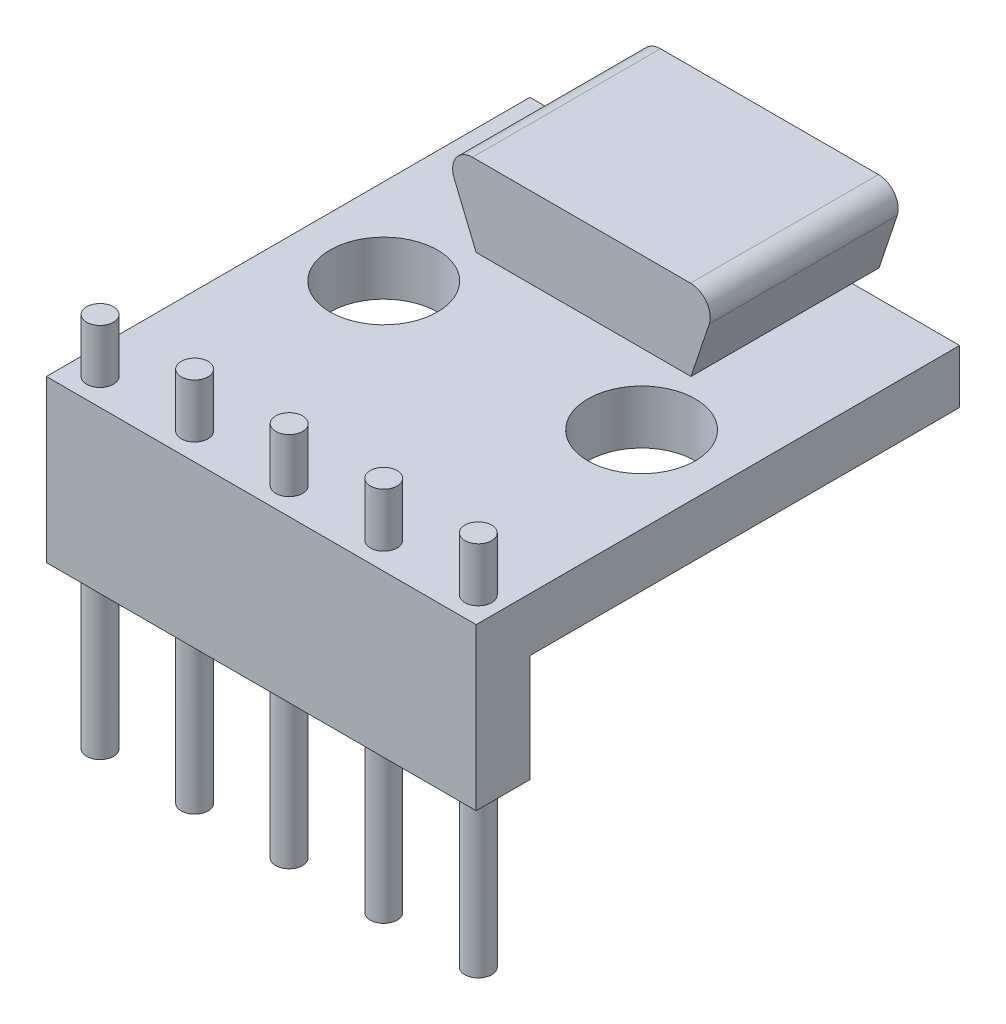
ISO-10303-21;
HEADER;
FILE_DESCRIPTION(('STEP AP214'),'2;1');
FILE_NAME('part.step','',(''),(''),'','','');
FILE_SCHEMA(('AUTOMOTIVE_DESIGN { 1 0 10303 214 1 1 1 1 }'));
ENDSEC;
DATA;
#1=APPLICATION_CONTEXT('core data for automotive mechanical design processes');
#2=APPLICATION_PROTOCOL_DEFINITION('international standard','automotive_design',2000,#1);
#3=PRODUCT_CONTEXT('',#1,'mechanical');
#4=PRODUCT('Part','Part','',(#3));
#5=PRODUCT_RELATED_PRODUCT_CATEGORY('part','',(#4));
#6=PRODUCT_DEFINITION_FORMATION('','',#4);
#7=PRODUCT_DEFINITION_CONTEXT('part definition',#1,'design');
#8=PRODUCT_DEFINITION('design','',#6,#7);
#9=PRODUCT_DEFINITION_SHAPE('','',#8);
#10=(LENGTH_UNIT() NAMED_UNIT(*) SI_UNIT(.MILLI.,.METRE.));
#11=(NAMED_UNIT(*) PLANE_ANGLE_UNIT() SI_UNIT($,.RADIAN.));
#12=(NAMED_UNIT(*) SI_UNIT($,.STERADIAN.) SOLID_ANGLE_UNIT());
#13=UNCERTAINTY_MEASURE_WITH_UNIT(LENGTH_MEASURE(1.E-05),#10,'distance_accuracy_value','');
#14=(GEOMETRIC_REPRESENTATION_CONTEXT(3) GLOBAL_UNCERTAINTY_ASSIGNED_CONTEXT((#13)) GLOBAL_UNIT_ASSIGNED_CONTEXT((#10,
#11,#12)) REPRESENTATION_CONTEXT('',''));
#15=CARTESIAN_POINT('',(0.,0.,0.));
#16=DIRECTION('',(0.,0.,1.));
#17=DIRECTION('',(1.,0.,0.));
#18=AXIS2_PLACEMENT_3D('',#15,#16,#17);
#19=CARTESIAN_POINT('',(0.,0.,0.));
#20=DIRECTION('',(0.,1.,0.));
#21=DIRECTION('',(0.,0.,1.));
#22=AXIS2_PLACEMENT_3D('',#19,#20,#21);
#23=PLANE('',#22);
#24=CARTESIAN_POINT('',(0.79375,0.,13.49375));
#25=DIRECTION('',(0.,1.,0.));
#26=DIRECTION('',(0.,0.,1.));
#27=AXIS2_PLACEMENT_3D('',#24,#25,#26);
#28=CIRCLE('',#27,0.396875);
#29=CARTESIAN_POINT('',(0.79375,0.,13.890625));
#30=VERTEX_POINT('',#29);
#31=EDGE_CURVE('E224',#30,#30,#28,.T.);
#32=ORIENTED_EDGE('',*,*,#31,.F.);
#33=EDGE_LOOP('',(#32));
#34=FACE_BOUND('',#33,.T.);
#35=CARTESIAN_POINT('',(3.58775,0.,13.49375));
#36=DIRECTION('',(0.,1.,0.));
#37=DIRECTION('',(0.,0.,1.));
#38=AXIS2_PLACEMENT_3D('',#35,#36,#37);
#39=CIRCLE('',#38,0.396875);
#40=CARTESIAN_POINT('',(3.58775,0.,13.890625));
#41=VERTEX_POINT('',#40);
#42=EDGE_CURVE('E228',#41,#41,#39,.T.);
#43=ORIENTED_EDGE('',*,*,#42,.F.);
#44=EDGE_LOOP('',(#43));
#45=FACE_BOUND('',#44,.T.);
#46=CARTESIAN_POINT('',(6.38175,0.,13.49375));
#47=DIRECTION('',(0.,1.,0.));
#48=DIRECTION('',(0.,0.,1.));
#49=AXIS2_PLACEMENT_3D('',#46,#47,#48);
#50=CIRCLE('',#49,0.396875);
#51=CARTESIAN_POINT('',(6.38175,0.,13.890625));
#52=VERTEX_POINT('',#51);
#53=EDGE_CURVE('E231',#52,#52,#50,.T.);
#54=ORIENTED_EDGE('',*,*,#53,.F.);
#55=EDGE_LOOP('',(#54));
#56=FACE_BOUND('',#55,.T.);
#57=CARTESIAN_POINT('',(9.17575,0.,13.49375));
#58=DIRECTION('',(0.,1.,0.));
#59=DIRECTION('',(0.,0.,1.));
#60=AXIS2_PLACEMENT_3D('',#57,#58,#59);
#61=CIRCLE('',#60,0.396875000000001);
#62=CARTESIAN_POINT('',(9.17575,0.,13.890625));
#63=VERTEX_POINT('',#62);
#64=EDGE_CURVE('E234',#63,#63,#61,.T.);
#65=ORIENTED_EDGE('',*,*,#64,.F.);
#66=EDGE_LOOP('',(#65));
#67=FACE_BOUND('',#66,.T.);
#68=CARTESIAN_POINT('',(11.96975,0.,13.49375));
#69=DIRECTION('',(0.,1.,0.));
#70=DIRECTION('',(0.,0.,1.));
#71=AXIS2_PLACEMENT_3D('',#68,#69,#70);
#72=CIRCLE('',#71,0.396875000000001);
#73=CARTESIAN_POINT('',(11.96975,0.,13.890625));
#74=VERTEX_POINT('',#73);
#75=EDGE_CURVE('E223',#74,#74,#72,.T.);
#76=ORIENTED_EDGE('',*,*,#75,.F.);
#77=EDGE_LOOP('',(#76));
#78=FACE_BOUND('',#77,.T.);
#79=CARTESIAN_POINT('',(2.54,0.,6.858));
#80=DIRECTION('',(0.,1.,0.));
#81=DIRECTION('',(0.,0.,1.));
#82=AXIS2_PLACEMENT_3D('',#79,#80,#81);
#83=CIRCLE('',#82,1.5875);
#84=CARTESIAN_POINT('',(2.54,0.,8.4455));
#85=VERTEX_POINT('',#84);
#86=EDGE_CURVE('E256',#85,#85,#83,.T.);
#87=ORIENTED_EDGE('',*,*,#86,.F.);
#88=EDGE_LOOP('',(#87));
#89=FACE_BOUND('',#88,.T.);
#90=CARTESIAN_POINT('',(10.16,0.,6.858));
#91=DIRECTION('',(0.,1.,0.));
#92=DIRECTION('',(0.,0.,1.));
#93=AXIS2_PLACEMENT_3D('',#90,#91,#92);
#94=CIRCLE('',#93,1.5875);
#95=CARTESIAN_POINT('',(10.16,0.,8.4455));
#96=VERTEX_POINT('',#95);
#97=EDGE_CURVE('E262',#96,#96,#94,.T.);
#98=ORIENTED_EDGE('',*,*,#97,.F.);
#99=EDGE_LOOP('',(#98));
#100=FACE_BOUND('',#99,.T.);
#101=DIRECTION('',(-1.,0.,0.));
#102=VECTOR('',#101,1.);
#103=CARTESIAN_POINT('',(3.175,0.,4.7625));
#104=LINE('',#103,#102);
#105=CARTESIAN_POINT('',(9.525,0.,4.7625));
#106=VERTEX_POINT('',#105);
#107=CARTESIAN_POINT('',(3.175,0.,4.7625));
#108=VERTEX_POINT('',#107);
#109=EDGE_CURVE('E47',#106,#108,#104,.T.);
#110=ORIENTED_EDGE('',*,*,#109,.T.);
#111=DIRECTION('',(0.,0.,-1.));
#112=VECTOR('',#111,1.);
#113=CARTESIAN_POINT('',(3.175,0.,0.));
#114=LINE('',#113,#112);
#115=CARTESIAN_POINT('',(3.175,0.,0.));
#116=VERTEX_POINT('',#115);
#117=EDGE_CURVE('E11',#108,#116,#114,.T.);
#118=ORIENTED_EDGE('',*,*,#117,.T.);
#119=DIRECTION('',(-1.,0.,0.));
#120=VECTOR('',#119,1.);
#121=CARTESIAN_POINT('',(0.,0.,0.));
#122=LINE('',#121,#120);
#123=CARTESIAN_POINT('',(0.,0.,0.));
#124=VERTEX_POINT('',#123);
#125=EDGE_CURVE('E289',#116,#124,#122,.T.);
#126=ORIENTED_EDGE('',*,*,#125,.T.);
#127=DIRECTION('',(0.,0.,1.));
#128=VECTOR('',#127,1.);
#129=CARTESIAN_POINT('',(0.,0.,0.));
#130=LINE('',#129,#128);
#131=CARTESIAN_POINT('',(0.,0.,14.2875));
#132=VERTEX_POINT('',#131);
#133=EDGE_CURVE('E268',#124,#132,#130,.T.);
#134=ORIENTED_EDGE('',*,*,#133,.T.);
#135=DIRECTION('',(1.,0.,0.));
#136=VECTOR('',#135,1.);
#137=CARTESIAN_POINT('',(0.,0.,14.2875));
#138=LINE('',#137,#136);
#139=CARTESIAN_POINT('',(12.7,0.,14.2875));
#140=VERTEX_POINT('',#139);
#141=EDGE_CURVE('E283',#132,#140,#138,.T.);
#142=ORIENTED_EDGE('',*,*,#141,.T.);
#143=DIRECTION('',(0.,0.,-1.));
#144=VECTOR('',#143,1.);
#145=CARTESIAN_POINT('',(12.7,0.,0.));
#146=LINE('',#145,#144);
#147=CARTESIAN_POINT('',(12.7,0.,0.));
#148=VERTEX_POINT('',#147);
#149=EDGE_CURVE('E286',#140,#148,#146,.T.);
#150=ORIENTED_EDGE('',*,*,#149,.T.);
#151=CARTESIAN_POINT('',(9.525,0.,0.));
#152=VERTEX_POINT('',#151);
#153=EDGE_CURVE('E275',#148,#152,#122,.T.);
#154=ORIENTED_EDGE('',*,*,#153,.T.);
#155=DIRECTION('',(0.,0.,1.));
#156=VECTOR('',#155,1.);
#157=CARTESIAN_POINT('',(9.525,0.,0.));
#158=LINE('',#157,#156);
#159=EDGE_CURVE('E41',#152,#106,#158,.T.);
#160=ORIENTED_EDGE('',*,*,#159,.T.);
#161=EDGE_LOOP('',(#110,#118,#126,#134,#142,#150,#154,#160));
#162=FACE_BOUND('',#161,.T.);
#163=ADVANCED_FACE('F33',(#34,#45,#56,#67,#78,#89,#100,#162),#23,.T.);
#164=CARTESIAN_POINT('',(0.,-1.5875,0.));
#165=DIRECTION('',(-1.,0.,0.));
#166=DIRECTION('',(0.,0.,1.));
#167=AXIS2_PLACEMENT_3D('',#164,#165,#166);
#168=PLANE('',#167);
#169=ORIENTED_EDGE('',*,*,#133,.F.);
#170=DIRECTION('',(0.,1.,0.));
#171=VECTOR('',#170,1.);
#172=CARTESIAN_POINT('',(0.,-1.5875,0.));
#173=LINE('',#172,#171);
#174=CARTESIAN_POINT('',(0.,-1.5875,0.));
#175=VERTEX_POINT('',#174);
#176=EDGE_CURVE('E293',#175,#124,#173,.T.);
#177=ORIENTED_EDGE('',*,*,#176,.F.);
#178=DIRECTION('',(0.,0.,1.));
#179=VECTOR('',#178,1.);
#180=CARTESIAN_POINT('',(0.,-1.5875,0.));
#181=LINE('',#180,#179);
#182=CARTESIAN_POINT('',(0.,-1.5875,12.7));
#183=VERTEX_POINT('',#182);
#184=EDGE_CURVE('E271',#175,#183,#181,.T.);
#185=ORIENTED_EDGE('',*,*,#184,.T.);
#186=DIRECTION('',(0.,-1.,0.));
#187=VECTOR('',#186,1.);
#188=CARTESIAN_POINT('',(0.,-1.5875,12.7));
#189=LINE('',#188,#187);
#190=CARTESIAN_POINT('',(0.,-4.7625,12.7));
#191=VERTEX_POINT('',#190);
#192=EDGE_CURVE('E239',#183,#191,#189,.T.);
#193=ORIENTED_EDGE('',*,*,#192,.T.);
#194=DIRECTION('',(0.,0.,1.));
#195=VECTOR('',#194,1.);
#196=CARTESIAN_POINT('',(0.,-4.7625,12.7));
#197=LINE('',#196,#195);
#198=CARTESIAN_POINT('',(0.,-4.7625,14.2875));
#199=VERTEX_POINT('',#198);
#200=EDGE_CURVE('E250',#191,#199,#197,.T.);
#201=ORIENTED_EDGE('',*,*,#200,.T.);
#202=DIRECTION('',(0.,1.,0.));
#203=VECTOR('',#202,1.);
#204=CARTESIAN_POINT('',(0.,-1.5875,14.2875));
#205=LINE('',#204,#203);
#206=EDGE_CURVE('E280',#199,#132,#205,.T.);
#207=ORIENTED_EDGE('',*,*,#206,.T.);
#208=EDGE_LOOP('',(#169,#177,#185,#193,#201,#207));
#209=FACE_BOUND('',#208,.T.);
#210=ADVANCED_FACE('F35',(#209),#168,.T.);
#211=CARTESIAN_POINT('',(0.,-1.5875,0.));
#212=DIRECTION('',(0.,0.,-1.));
#213=DIRECTION('',(-1.,0.,0.));
#214=AXIS2_PLACEMENT_3D('',#211,#212,#213);
#215=PLANE('',#214);
#216=ORIENTED_EDGE('',*,*,#153,.F.);
#217=DIRECTION('',(0.,1.,0.));
#218=VECTOR('',#217,1.);
#219=CARTESIAN_POINT('',(12.7,-1.5875,0.));
#220=LINE('',#219,#218);
#221=CARTESIAN_POINT('',(12.7,-1.5875,0.));
#222=VERTEX_POINT('',#221);
#223=EDGE_CURVE('E296',#222,#148,#220,.T.);
#224=ORIENTED_EDGE('',*,*,#223,.F.);
#225=DIRECTION('',(-1.,0.,0.));
#226=VECTOR('',#225,1.);
#227=CARTESIAN_POINT('',(0.,-1.5875,0.));
#228=LINE('',#227,#226);
#229=EDGE_CURVE('E277',#222,#175,#228,.T.);
#230=ORIENTED_EDGE('',*,*,#229,.T.);
#231=ORIENTED_EDGE('',*,*,#176,.T.);
#232=ORIENTED_EDGE('',*,*,#125,.F.);
#233=EDGE_CURVE('E292',#152,#116,#122,.T.);
#234=ORIENTED_EDGE('',*,*,#233,.F.);
#235=EDGE_LOOP('',(#216,#224,#230,#231,#232,#234));
#236=FACE_BOUND('',#235,.T.);
#237=ADVANCED_FACE('F324',(#236),#215,.T.);
#238=CARTESIAN_POINT('',(12.7,-1.5875,0.));
#239=DIRECTION('',(1.,0.,0.));
#240=DIRECTION('',(0.,0.,-1.));
#241=AXIS2_PLACEMENT_3D('',#238,#239,#240);
#242=PLANE('',#241);
#243=ORIENTED_EDGE('',*,*,#149,.F.);
#244=DIRECTION('',(0.,1.,0.));
#245=VECTOR('',#244,1.);
#246=CARTESIAN_POINT('',(12.7,-1.5875,14.2875));
#247=LINE('',#246,#245);
#248=CARTESIAN_POINT('',(12.7,-4.7625,14.2875));
#249=VERTEX_POINT('',#248);
#250=EDGE_CURVE('E298',#249,#140,#247,.T.);
#251=ORIENTED_EDGE('',*,*,#250,.F.);
#252=DIRECTION('',(0.,0.,1.));
#253=VECTOR('',#252,1.);
#254=CARTESIAN_POINT('',(12.7,-4.7625,12.7));
#255=LINE('',#254,#253);
#256=CARTESIAN_POINT('',(12.7,-4.7625,12.7));
#257=VERTEX_POINT('',#256);
#258=EDGE_CURVE('E253',#257,#249,#255,.T.);
#259=ORIENTED_EDGE('',*,*,#258,.F.);
#260=DIRECTION('',(0.,1.,0.));
#261=VECTOR('',#260,1.);
#262=CARTESIAN_POINT('',(12.7,-1.5875,12.7));
#263=LINE('',#262,#261);
#264=CARTESIAN_POINT('',(12.7,-1.5875,12.7));
#265=VERTEX_POINT('',#264);
#266=EDGE_CURVE('E245',#257,#265,#263,.T.);
#267=ORIENTED_EDGE('',*,*,#266,.T.);
#268=DIRECTION('',(0.,0.,-1.));
#269=VECTOR('',#268,1.);
#270=CARTESIAN_POINT('',(12.7,-1.5875,0.));
#271=LINE('',#270,#269);
#272=EDGE_CURVE('E274',#265,#222,#271,.T.);
#273=ORIENTED_EDGE('',*,*,#272,.T.);
#274=ORIENTED_EDGE('',*,*,#223,.T.);
#275=EDGE_LOOP('',(#243,#251,#259,#267,#273,#274));
#276=FACE_BOUND('',#275,.T.);
#277=ADVANCED_FACE('F345',(#276),#242,.T.);
#278=CARTESIAN_POINT('',(0.,-1.5875,14.2875));
#279=DIRECTION('',(0.,0.,1.));
#280=DIRECTION('',(1.,0.,0.));
#281=AXIS2_PLACEMENT_3D('',#278,#279,#280);
#282=PLANE('',#281);
#283=ORIENTED_EDGE('',*,*,#141,.F.);
#284=ORIENTED_EDGE('',*,*,#206,.F.);
#285=DIRECTION('',(1.,0.,0.));
#286=VECTOR('',#285,1.);
#287=CARTESIAN_POINT('',(0.,-4.7625,14.2875));
#288=LINE('',#287,#286);
#289=EDGE_CURVE('E227',#199,#249,#288,.T.);
#290=ORIENTED_EDGE('',*,*,#289,.T.);
#291=ORIENTED_EDGE('',*,*,#250,.T.);
#292=EDGE_LOOP('',(#283,#284,#290,#291));
#293=FACE_BOUND('',#292,.T.);
#294=ADVANCED_FACE('F332',(#293),#282,.T.);
#295=CARTESIAN_POINT('',(0.,-1.5875,0.));
#296=DIRECTION('',(0.,1.,0.));
#297=DIRECTION('',(0.,0.,1.));
#298=AXIS2_PLACEMENT_3D('',#295,#296,#297);
#299=PLANE('',#298);
#300=CARTESIAN_POINT('',(2.54,-1.5875,6.858));
#301=DIRECTION('',(0.,1.,0.));
#302=DIRECTION('',(0.,0.,1.));
#303=AXIS2_PLACEMENT_3D('',#300,#301,#302);
#304=CIRCLE('',#303,1.5875);
#305=CARTESIAN_POINT('',(2.54,-1.5875,8.4455));
#306=VERTEX_POINT('',#305);
#307=EDGE_CURVE('E259',#306,#306,#304,.T.);
#308=ORIENTED_EDGE('',*,*,#307,.T.);
#309=EDGE_LOOP('',(#308));
#310=FACE_BOUND('',#309,.T.);
#311=CARTESIAN_POINT('',(10.16,-1.5875,6.858));
#312=DIRECTION('',(0.,1.,0.));
#313=DIRECTION('',(0.,0.,1.));
#314=AXIS2_PLACEMENT_3D('',#311,#312,#313);
#315=CIRCLE('',#314,1.5875);
#316=CARTESIAN_POINT('',(10.16,-1.5875,8.4455));
#317=VERTEX_POINT('',#316);
#318=EDGE_CURVE('E265',#317,#317,#315,.T.);
#319=ORIENTED_EDGE('',*,*,#318,.T.);
#320=EDGE_LOOP('',(#319));
#321=FACE_BOUND('',#320,.T.);
#322=ORIENTED_EDGE('',*,*,#272,.F.);
#323=DIRECTION('',(-1.,0.,0.));
#324=VECTOR('',#323,1.);
#325=CARTESIAN_POINT('',(0.,-1.5875,12.7));
#326=LINE('',#325,#324);
#327=EDGE_CURVE('E247',#265,#183,#326,.T.);
#328=ORIENTED_EDGE('',*,*,#327,.T.);
#329=ORIENTED_EDGE('',*,*,#184,.F.);
#330=ORIENTED_EDGE('',*,*,#229,.F.);
#331=EDGE_LOOP('',(#322,#328,#329,#330));
#332=FACE_BOUND('',#331,.T.);
#333=ADVANCED_FACE('F337',(#310,#321,#332),#299,.F.);
#334=CARTESIAN_POINT('',(10.16,-1.5875,6.858));
#335=DIRECTION('',(0.,1.,0.));
#336=DIRECTION('',(0.,0.,1.));
#337=AXIS2_PLACEMENT_3D('',#334,#335,#336);
#338=CYLINDRICAL_SURFACE('',#337,1.5875);
#339=ORIENTED_EDGE('',*,*,#318,.F.);
#340=EDGE_LOOP('',(#339));
#341=FACE_BOUND('',#340,.T.);
#342=ORIENTED_EDGE('',*,*,#97,.T.);
#343=EDGE_LOOP('',(#342));
#344=FACE_BOUND('',#343,.T.);
#345=ADVANCED_FACE('F364',(#341,#344),#338,.F.);
#346=CARTESIAN_POINT('',(2.54,-1.5875,6.858));
#347=DIRECTION('',(0.,1.,0.));
#348=DIRECTION('',(0.,0.,1.));
#349=AXIS2_PLACEMENT_3D('',#346,#347,#348);
#350=CYLINDRICAL_SURFACE('',#349,1.5875);
#351=ORIENTED_EDGE('',*,*,#307,.F.);
#352=EDGE_LOOP('',(#351));
#353=FACE_BOUND('',#352,.T.);
#354=ORIENTED_EDGE('',*,*,#86,.T.);
#355=EDGE_LOOP('',(#354));
#356=FACE_BOUND('',#355,.T.);
#357=ADVANCED_FACE('F368',(#353,#356),#350,.F.);
#358=CARTESIAN_POINT('',(0.,-4.7625,12.7));
#359=DIRECTION('',(0.,-1.,0.));
#360=DIRECTION('',(0.,0.,-1.));
#361=AXIS2_PLACEMENT_3D('',#358,#359,#360);
#362=PLANE('',#361);
#363=CARTESIAN_POINT('',(0.79375,-4.7625,13.49375));
#364=DIRECTION('',(0.,-1.,0.));
#365=DIRECTION('',(0.,0.,-1.));
#366=AXIS2_PLACEMENT_3D('',#363,#364,#365);
#367=CIRCLE('',#366,0.396874999999999);
#368=CARTESIAN_POINT('',(0.79375,-4.7625,13.096875));
#369=VERTEX_POINT('',#368);
#370=EDGE_CURVE('E220',#369,#369,#367,.T.);
#371=ORIENTED_EDGE('',*,*,#370,.F.);
#372=EDGE_LOOP('',(#371));
#373=FACE_BOUND('',#372,.T.);
#374=CARTESIAN_POINT('',(3.58775,-4.7625,13.49375));
#375=DIRECTION('',(0.,-1.,0.));
#376=DIRECTION('',(0.,0.,-1.));
#377=AXIS2_PLACEMENT_3D('',#374,#375,#376);
#378=CIRCLE('',#377,0.396875);
#379=CARTESIAN_POINT('',(3.58775,-4.7625,13.096875));
#380=VERTEX_POINT('',#379);
#381=EDGE_CURVE('E211',#380,#380,#378,.T.);
#382=ORIENTED_EDGE('',*,*,#381,.F.);
#383=EDGE_LOOP('',(#382));
#384=FACE_BOUND('',#383,.T.);
#385=CARTESIAN_POINT('',(6.38175,-4.7625,13.49375));
#386=DIRECTION('',(0.,-1.,0.));
#387=DIRECTION('',(0.,0.,-1.));
#388=AXIS2_PLACEMENT_3D('',#385,#386,#387);
#389=CIRCLE('',#388,0.396875);
#390=CARTESIAN_POINT('',(6.38175,-4.7625,13.096875));
#391=VERTEX_POINT('',#390);
#392=EDGE_CURVE('E202',#391,#391,#389,.T.);
#393=ORIENTED_EDGE('',*,*,#392,.F.);
#394=EDGE_LOOP('',(#393));
#395=FACE_BOUND('',#394,.T.);
#396=CARTESIAN_POINT('',(9.17575,-4.7625,13.49375));
#397=DIRECTION('',(0.,-1.,0.));
#398=DIRECTION('',(0.,0.,-1.));
#399=AXIS2_PLACEMENT_3D('',#396,#397,#398);
#400=CIRCLE('',#399,0.396875);
#401=CARTESIAN_POINT('',(9.17575,-4.7625,13.096875));
#402=VERTEX_POINT('',#401);
#403=EDGE_CURVE('E193',#402,#402,#400,.T.);
#404=ORIENTED_EDGE('',*,*,#403,.F.);
#405=EDGE_LOOP('',(#404));
#406=FACE_BOUND('',#405,.T.);
#407=CARTESIAN_POINT('',(11.96975,-4.7625,13.49375));
#408=DIRECTION('',(0.,-1.,0.));
#409=DIRECTION('',(0.,0.,-1.));
#410=AXIS2_PLACEMENT_3D('',#407,#408,#409);
#411=CIRCLE('',#410,0.396875);
#412=CARTESIAN_POINT('',(11.96975,-4.7625,13.096875));
#413=VERTEX_POINT('',#412);
#414=EDGE_CURVE('E184',#413,#413,#411,.T.);
#415=ORIENTED_EDGE('',*,*,#414,.F.);
#416=EDGE_LOOP('',(#415));
#417=FACE_BOUND('',#416,.T.);
#418=ORIENTED_EDGE('',*,*,#289,.F.);
#419=ORIENTED_EDGE('',*,*,#200,.F.);
#420=DIRECTION('',(1.,0.,0.));
#421=VECTOR('',#420,1.);
#422=CARTESIAN_POINT('',(0.,-4.7625,12.7));
#423=LINE('',#422,#421);
#424=EDGE_CURVE('E242',#191,#257,#423,.T.);
#425=ORIENTED_EDGE('',*,*,#424,.T.);
#426=ORIENTED_EDGE('',*,*,#258,.T.);
#427=EDGE_LOOP('',(#418,#419,#425,#426));
#428=FACE_BOUND('',#427,.T.);
#429=ADVANCED_FACE('F344',(#373,#384,#395,#406,#417,#428),#362,.T.);
#430=CARTESIAN_POINT('',(0.,0.,12.7));
#431=DIRECTION('',(0.,0.,1.));
#432=DIRECTION('',(1.,0.,0.));
#433=AXIS2_PLACEMENT_3D('',#430,#431,#432);
#434=PLANE('',#433);
#435=ORIENTED_EDGE('',*,*,#192,.F.);
#436=ORIENTED_EDGE('',*,*,#327,.F.);
#437=ORIENTED_EDGE('',*,*,#266,.F.);
#438=ORIENTED_EDGE('',*,*,#424,.F.);
#439=EDGE_LOOP('',(#435,#436,#437,#438));
#440=FACE_BOUND('',#439,.T.);
#441=ADVANCED_FACE('F341',(#440),#434,.F.);
#442=CARTESIAN_POINT('',(0.79375,-9.525,13.49375));
#443=DIRECTION('',(0.,1.,0.));
#444=DIRECTION('',(0.,0.,1.));
#445=AXIS2_PLACEMENT_3D('',#442,#443,#444);
#446=PLANE('',#445);
#447=CARTESIAN_POINT('',(0.79375,-9.525,13.49375));
#448=DIRECTION('',(0.,1.,0.));
#449=DIRECTION('',(0.,0.,1.));
#450=AXIS2_PLACEMENT_3D('',#447,#448,#449);
#451=CIRCLE('',#450,0.396874999999999);
#452=CARTESIAN_POINT('',(0.79375,-9.525,13.890625));
#453=VERTEX_POINT('',#452);
#454=EDGE_CURVE('E217',#453,#453,#451,.T.);
#455=ORIENTED_EDGE('',*,*,#454,.F.);
#456=EDGE_LOOP('',(#455));
#457=FACE_BOUND('',#456,.T.);
#458=ADVANCED_FACE('F378',(#457),#446,.F.);
#459=CARTESIAN_POINT('',(0.79375,-9.525,13.49375));
#460=DIRECTION('',(0.,1.,0.));
#461=DIRECTION('',(0.,0.,1.));
#462=AXIS2_PLACEMENT_3D('',#459,#460,#461);
#463=CYLINDRICAL_SURFACE('',#462,0.396874999999999);
#464=ORIENTED_EDGE('',*,*,#370,.T.);
#465=EDGE_LOOP('',(#464));
#466=FACE_BOUND('',#465,.T.);
#467=ORIENTED_EDGE('',*,*,#454,.T.);
#468=EDGE_LOOP('',(#467));
#469=FACE_BOUND('',#468,.T.);
#470=ADVANCED_FACE('F379',(#466,#469),#463,.T.);
#471=ORIENTED_EDGE('',*,*,#31,.T.);
#472=EDGE_LOOP('',(#471));
#473=FACE_BOUND('',#472,.T.);
#474=CARTESIAN_POINT('',(0.79375,1.5875,13.49375));
#475=DIRECTION('',(0.,1.,0.));
#476=DIRECTION('',(0.,0.,1.));
#477=AXIS2_PLACEMENT_3D('',#474,#475,#476);
#478=CIRCLE('',#477,0.396874999999999);
#479=CARTESIAN_POINT('',(0.79375,1.5875,13.890625));
#480=VERTEX_POINT('',#479);
#481=EDGE_CURVE('E214',#480,#480,#478,.T.);
#482=ORIENTED_EDGE('',*,*,#481,.F.);
#483=EDGE_LOOP('',(#482));
#484=FACE_BOUND('',#483,.T.);
#485=ADVANCED_FACE('F382',(#473,#484),#463,.T.);
#486=CARTESIAN_POINT('',(0.79375,1.5875,13.49375));
#487=DIRECTION('',(0.,1.,0.));
#488=DIRECTION('',(0.,0.,1.));
#489=AXIS2_PLACEMENT_3D('',#486,#487,#488);
#490=PLANE('',#489);
#491=ORIENTED_EDGE('',*,*,#481,.T.);
#492=EDGE_LOOP('',(#491));
#493=FACE_BOUND('',#492,.T.);
#494=ADVANCED_FACE('F387',(#493),#490,.T.);
#495=CARTESIAN_POINT('',(3.58775,-9.525,13.49375));
#496=DIRECTION('',(0.,1.,0.));
#497=DIRECTION('',(0.,0.,1.));
#498=AXIS2_PLACEMENT_3D('',#495,#496,#497);
#499=PLANE('',#498);
#500=CARTESIAN_POINT('',(3.58775,-9.525,13.49375));
#501=DIRECTION('',(0.,1.,0.));
#502=DIRECTION('',(0.,0.,1.));
#503=AXIS2_PLACEMENT_3D('',#500,#501,#502);
#504=CIRCLE('',#503,0.396875);
#505=CARTESIAN_POINT('',(3.58775,-9.525,13.890625));
#506=VERTEX_POINT('',#505);
#507=EDGE_CURVE('E208',#506,#506,#504,.T.);
#508=ORIENTED_EDGE('',*,*,#507,.F.);
#509=EDGE_LOOP('',(#508));
#510=FACE_BOUND('',#509,.T.);
#511=ADVANCED_FACE('F390',(#510),#499,.F.);
#512=CARTESIAN_POINT('',(3.58775,-9.525,13.49375));
#513=DIRECTION('',(0.,1.,0.));
#514=DIRECTION('',(0.,0.,1.));
#515=AXIS2_PLACEMENT_3D('',#512,#513,#514);
#516=CYLINDRICAL_SURFACE('',#515,0.396875);
#517=ORIENTED_EDGE('',*,*,#381,.T.);
#518=EDGE_LOOP('',(#517));
#519=FACE_BOUND('',#518,.T.);
#520=ORIENTED_EDGE('',*,*,#507,.T.);
#521=EDGE_LOOP('',(#520));
#522=FACE_BOUND('',#521,.T.);
#523=ADVANCED_FACE('F392',(#519,#522),#516,.T.);
#524=ORIENTED_EDGE('',*,*,#42,.T.);
#525=EDGE_LOOP('',(#524));
#526=FACE_BOUND('',#525,.T.);
#527=CARTESIAN_POINT('',(3.58775,1.5875,13.49375));
#528=DIRECTION('',(0.,1.,0.));
#529=DIRECTION('',(0.,0.,1.));
#530=AXIS2_PLACEMENT_3D('',#527,#528,#529);
#531=CIRCLE('',#530,0.396875);
#532=CARTESIAN_POINT('',(3.58775,1.5875,13.890625));
#533=VERTEX_POINT('',#532);
#534=EDGE_CURVE('E205',#533,#533,#531,.T.);
#535=ORIENTED_EDGE('',*,*,#534,.F.);
#536=EDGE_LOOP('',(#535));
#537=FACE_BOUND('',#536,.T.);
#538=ADVANCED_FACE('F395',(#526,#537),#516,.T.);
#539=CARTESIAN_POINT('',(3.58775,1.5875,13.49375));
#540=DIRECTION('',(0.,1.,0.));
#541=DIRECTION('',(0.,0.,1.));
#542=AXIS2_PLACEMENT_3D('',#539,#540,#541);
#543=PLANE('',#542);
#544=ORIENTED_EDGE('',*,*,#534,.T.);
#545=EDGE_LOOP('',(#544));
#546=FACE_BOUND('',#545,.T.);
#547=ADVANCED_FACE('F400',(#546),#543,.T.);
#548=CARTESIAN_POINT('',(6.38175,-9.525,13.49375));
#549=DIRECTION('',(0.,1.,0.));
#550=DIRECTION('',(0.,0.,1.));
#551=AXIS2_PLACEMENT_3D('',#548,#549,#550);
#552=PLANE('',#551);
#553=CARTESIAN_POINT('',(6.38175,-9.525,13.49375));
#554=DIRECTION('',(0.,1.,0.));
#555=DIRECTION('',(0.,0.,1.));
#556=AXIS2_PLACEMENT_3D('',#553,#554,#555);
#557=CIRCLE('',#556,0.396875);
#558=CARTESIAN_POINT('',(6.38175,-9.525,13.890625));
#559=VERTEX_POINT('',#558);
#560=EDGE_CURVE('E199',#559,#559,#557,.T.);
#561=ORIENTED_EDGE('',*,*,#560,.F.);
#562=EDGE_LOOP('',(#561));
#563=FACE_BOUND('',#562,.T.);
#564=ADVANCED_FACE('F403',(#563),#552,.F.);
#565=CARTESIAN_POINT('',(6.38175,-9.525,13.49375));
#566=DIRECTION('',(0.,1.,0.));
#567=DIRECTION('',(0.,0.,1.));
#568=AXIS2_PLACEMENT_3D('',#565,#566,#567);
#569=CYLINDRICAL_SURFACE('',#568,0.396875);
#570=ORIENTED_EDGE('',*,*,#392,.T.);
#571=EDGE_LOOP('',(#570));
#572=FACE_BOUND('',#571,.T.);
#573=ORIENTED_EDGE('',*,*,#560,.T.);
#574=EDGE_LOOP('',(#573));
#575=FACE_BOUND('',#574,.T.);
#576=ADVANCED_FACE('F405',(#572,#575),#569,.T.);
#577=ORIENTED_EDGE('',*,*,#53,.T.);
#578=EDGE_LOOP('',(#577));
#579=FACE_BOUND('',#578,.T.);
#580=CARTESIAN_POINT('',(6.38175,1.5875,13.49375));
#581=DIRECTION('',(0.,1.,0.));
#582=DIRECTION('',(0.,0.,1.));
#583=AXIS2_PLACEMENT_3D('',#580,#581,#582);
#584=CIRCLE('',#583,0.396875);
#585=CARTESIAN_POINT('',(6.38175,1.5875,13.890625));
#586=VERTEX_POINT('',#585);
#587=EDGE_CURVE('E196',#586,#586,#584,.T.);
#588=ORIENTED_EDGE('',*,*,#587,.F.);
#589=EDGE_LOOP('',(#588));
#590=FACE_BOUND('',#589,.T.);
#591=ADVANCED_FACE('F408',(#579,#590),#569,.T.);
#592=CARTESIAN_POINT('',(6.38175,1.5875,13.49375));
#593=DIRECTION('',(0.,1.,0.));
#594=DIRECTION('',(0.,0.,1.));
#595=AXIS2_PLACEMENT_3D('',#592,#593,#594);
#596=PLANE('',#595);
#597=ORIENTED_EDGE('',*,*,#587,.T.);
#598=EDGE_LOOP('',(#597));
#599=FACE_BOUND('',#598,.T.);
#600=ADVANCED_FACE('F413',(#599),#596,.T.);
#601=CARTESIAN_POINT('',(9.17575,-9.525,13.49375));
#602=DIRECTION('',(0.,1.,0.));
#603=DIRECTION('',(0.,0.,1.));
#604=AXIS2_PLACEMENT_3D('',#601,#602,#603);
#605=PLANE('',#604);
#606=CARTESIAN_POINT('',(9.17575,-9.525,13.49375));
#607=DIRECTION('',(0.,1.,0.));
#608=DIRECTION('',(0.,0.,1.));
#609=AXIS2_PLACEMENT_3D('',#606,#607,#608);
#610=CIRCLE('',#609,0.396875);
#611=CARTESIAN_POINT('',(9.17575,-9.525,13.890625));
#612=VERTEX_POINT('',#611);
#613=EDGE_CURVE('E190',#612,#612,#610,.T.);
#614=ORIENTED_EDGE('',*,*,#613,.F.);
#615=EDGE_LOOP('',(#614));
#616=FACE_BOUND('',#615,.T.);
#617=ADVANCED_FACE('F416',(#616),#605,.F.);
#618=CARTESIAN_POINT('',(9.17575,-9.525,13.49375));
#619=DIRECTION('',(0.,1.,0.));
#620=DIRECTION('',(0.,0.,1.));
#621=AXIS2_PLACEMENT_3D('',#618,#619,#620);
#622=CYLINDRICAL_SURFACE('',#621,0.396875);
#623=ORIENTED_EDGE('',*,*,#403,.T.);
#624=EDGE_LOOP('',(#623));
#625=FACE_BOUND('',#624,.T.);
#626=ORIENTED_EDGE('',*,*,#613,.T.);
#627=EDGE_LOOP('',(#626));
#628=FACE_BOUND('',#627,.T.);
#629=ADVANCED_FACE('F418',(#625,#628),#622,.T.);
#630=ORIENTED_EDGE('',*,*,#64,.T.);
#631=EDGE_LOOP('',(#630));
#632=FACE_BOUND('',#631,.T.);
#633=CARTESIAN_POINT('',(9.17575,1.5875,13.49375));
#634=DIRECTION('',(0.,1.,0.));
#635=DIRECTION('',(0.,0.,1.));
#636=AXIS2_PLACEMENT_3D('',#633,#634,#635);
#637=CIRCLE('',#636,0.396875);
#638=CARTESIAN_POINT('',(9.17575,1.5875,13.890625));
#639=VERTEX_POINT('',#638);
#640=EDGE_CURVE('E187',#639,#639,#637,.T.);
#641=ORIENTED_EDGE('',*,*,#640,.F.);
#642=EDGE_LOOP('',(#641));
#643=FACE_BOUND('',#642,.T.);
#644=ADVANCED_FACE('F421',(#632,#643),#622,.T.);
#645=CARTESIAN_POINT('',(9.17575,1.5875,13.49375));
#646=DIRECTION('',(0.,1.,0.));
#647=DIRECTION('',(0.,0.,1.));
#648=AXIS2_PLACEMENT_3D('',#645,#646,#647);
#649=PLANE('',#648);
#650=ORIENTED_EDGE('',*,*,#640,.T.);
#651=EDGE_LOOP('',(#650));
#652=FACE_BOUND('',#651,.T.);
#653=ADVANCED_FACE('F426',(#652),#649,.T.);
#654=CARTESIAN_POINT('',(11.96975,-9.525,13.49375));
#655=DIRECTION('',(0.,1.,0.));
#656=DIRECTION('',(0.,0.,1.));
#657=AXIS2_PLACEMENT_3D('',#654,#655,#656);
#658=PLANE('',#657);
#659=CARTESIAN_POINT('',(11.96975,-9.525,13.49375));
#660=DIRECTION('',(0.,1.,0.));
#661=DIRECTION('',(0.,0.,1.));
#662=AXIS2_PLACEMENT_3D('',#659,#660,#661);
#663=CIRCLE('',#662,0.396875);
#664=CARTESIAN_POINT('',(11.96975,-9.525,13.890625));
#665=VERTEX_POINT('',#664);
#666=EDGE_CURVE('E181',#665,#665,#663,.T.);
#667=ORIENTED_EDGE('',*,*,#666,.F.);
#668=EDGE_LOOP('',(#667));
#669=FACE_BOUND('',#668,.T.);
#670=ADVANCED_FACE('F429',(#669),#658,.F.);
#671=CARTESIAN_POINT('',(11.96975,-9.525,13.49375));
#672=DIRECTION('',(0.,1.,0.));
#673=DIRECTION('',(0.,0.,1.));
#674=AXIS2_PLACEMENT_3D('',#671,#672,#673);
#675=CYLINDRICAL_SURFACE('',#674,0.396875);
#676=ORIENTED_EDGE('',*,*,#414,.T.);
#677=EDGE_LOOP('',(#676));
#678=FACE_BOUND('',#677,.T.);
#679=ORIENTED_EDGE('',*,*,#666,.T.);
#680=EDGE_LOOP('',(#679));
#681=FACE_BOUND('',#680,.T.);
#682=ADVANCED_FACE('F431',(#678,#681),#675,.T.);
#683=ORIENTED_EDGE('',*,*,#75,.T.);
#684=EDGE_LOOP('',(#683));
#685=FACE_BOUND('',#684,.T.);
#686=CARTESIAN_POINT('',(11.96975,1.5875,13.49375));
#687=DIRECTION('',(0.,1.,0.));
#688=DIRECTION('',(0.,0.,1.));
#689=AXIS2_PLACEMENT_3D('',#686,#687,#688);
#690=CIRCLE('',#689,0.396875);
#691=CARTESIAN_POINT('',(11.96975,1.5875,13.890625));
#692=VERTEX_POINT('',#691);
#693=EDGE_CURVE('E178',#692,#692,#690,.T.);
#694=ORIENTED_EDGE('',*,*,#693,.F.);
#695=EDGE_LOOP('',(#694));
#696=FACE_BOUND('',#695,.T.);
#697=ADVANCED_FACE('F434',(#685,#696),#675,.T.);
#698=CARTESIAN_POINT('',(11.96975,1.5875,13.49375));
#699=DIRECTION('',(0.,1.,0.));
#700=DIRECTION('',(0.,0.,1.));
#701=AXIS2_PLACEMENT_3D('',#698,#699,#700);
#702=PLANE('',#701);
#703=ORIENTED_EDGE('',*,*,#693,.T.);
#704=EDGE_LOOP('',(#703));
#705=FACE_BOUND('',#704,.T.);
#706=ADVANCED_FACE('F439',(#705),#702,.T.);
#707=CARTESIAN_POINT('',(3.175,0.,-0.79375));
#708=DIRECTION('',(0.,1.,0.));
#709=DIRECTION('',(0.,0.,1.));
#710=AXIS2_PLACEMENT_3D('',#707,#708,#709);
#711=PLANE('',#710);
#712=ORIENTED_EDGE('',*,*,#233,.T.);
#713=DIRECTION('',(0.,0.,1.));
#714=VECTOR('',#713,1.);
#715=CARTESIAN_POINT('',(3.175,0.,-0.79375));
#716=LINE('',#715,#714);
#717=CARTESIAN_POINT('',(3.175,0.,-0.79375));
#718=VERTEX_POINT('',#717);
#719=EDGE_CURVE('E133',#718,#116,#716,.T.);
#720=ORIENTED_EDGE('',*,*,#719,.F.);
#721=DIRECTION('',(-1.,0.,0.));
#722=VECTOR('',#721,1.);
#723=CARTESIAN_POINT('',(3.175,0.,-0.79375));
#724=LINE('',#723,#722);
#725=CARTESIAN_POINT('',(9.525,0.,-0.79375));
#726=VERTEX_POINT('',#725);
#727=EDGE_CURVE('E157',#726,#718,#724,.T.);
#728=ORIENTED_EDGE('',*,*,#727,.F.);
#729=DIRECTION('',(0.,0.,1.));
#730=VECTOR('',#729,1.);
#731=CARTESIAN_POINT('',(9.525,0.,-0.79375));
#732=LINE('',#731,#730);
#733=EDGE_CURVE('E169',#726,#152,#732,.T.);
#734=ORIENTED_EDGE('',*,*,#733,.T.);
#735=EDGE_LOOP('',(#712,#720,#728,#734));
#736=FACE_BOUND('',#735,.T.);
#737=ADVANCED_FACE('F321',(#736),#711,.F.);
#738=CARTESIAN_POINT('',(2.52489079114307,1.5734305855913,-0.79375));
#739=DIRECTION('',(0.924217073831955,0.381867516866121,0.));
#740=DIRECTION('',(-0.381867516866122,0.924217073831956,0.));
#741=AXIS2_PLACEMENT_3D('',#738,#739,#740);
#742=PLANE('',#741);
#743=ORIENTED_EDGE('',*,*,#719,.T.);
#744=ORIENTED_EDGE('',*,*,#117,.F.);
#745=DIRECTION('',(-0.381867516866122,0.924217073831956,0.));
#746=VECTOR('',#745,1.);
#747=CARTESIAN_POINT('',(2.52489079114307,1.5734305855913,4.7625));
#748=LINE('',#747,#746);
#749=CARTESIAN_POINT('',(2.52489079114307,1.5734305855913,4.7625));
#750=VERTEX_POINT('',#749);
#751=EDGE_CURVE('E140',#108,#750,#748,.T.);
#752=ORIENTED_EDGE('',*,*,#751,.T.);
#753=DIRECTION('',(0.,0.,1.));
#754=VECTOR('',#753,1.);
#755=CARTESIAN_POINT('',(2.52489079114307,1.5734305855913,-0.79375));
#756=LINE('',#755,#754);
#757=CARTESIAN_POINT('',(2.52489079114307,1.5734305855913,-0.79375));
#758=VERTEX_POINT('',#757);
#759=EDGE_CURVE('E125',#758,#750,#756,.T.);
#760=ORIENTED_EDGE('',*,*,#759,.F.);
#761=DIRECTION('',(-0.381867516866122,0.924217073831956,0.));
#762=VECTOR('',#761,1.);
#763=CARTESIAN_POINT('',(2.52489079114307,1.5734305855913,-0.79375));
#764=LINE('',#763,#762);
#765=EDGE_CURVE('E160',#718,#758,#764,.T.);
#766=ORIENTED_EDGE('',*,*,#765,.F.);
#767=EDGE_LOOP('',(#743,#744,#752,#760,#766));
#768=FACE_BOUND('',#767,.T.);
#769=ADVANCED_FACE('F146',(#768),#742,.F.);
#770=CARTESIAN_POINT('',(3.06517449146671,1.7966647162814,-0.79375));
#771=DIRECTION('',(0.,0.,1.));
#772=DIRECTION('',(1.,0.,0.));
#773=AXIS2_PLACEMENT_3D('',#770,#771,#772);
#774=CYLINDRICAL_SURFACE('',#773,0.584585283718603);
#775=ORIENTED_EDGE('',*,*,#759,.T.);
#776=CARTESIAN_POINT('',(3.06517449146671,1.7966647162814,4.7625));
#777=DIRECTION('',(0.,0.,-1.));
#778=DIRECTION('',(1.,0.,0.));
#779=AXIS2_PLACEMENT_3D('',#776,#777,#778);
#780=CIRCLE('',#779,0.584585283718603);
#781=CARTESIAN_POINT('',(3.06517449146671,2.38125,4.7625));
#782=VERTEX_POINT('',#781);
#783=EDGE_CURVE('E129',#750,#782,#780,.T.);
#784=ORIENTED_EDGE('',*,*,#783,.T.);
#785=DIRECTION('',(0.,0.,1.));
#786=VECTOR('',#785,1.);
#787=CARTESIAN_POINT('',(3.06517449146671,2.38125,-0.79375));
#788=LINE('',#787,#786);
#789=CARTESIAN_POINT('',(3.06517449146671,2.38125,-0.79375));
#790=VERTEX_POINT('',#789);
#791=EDGE_CURVE('E134',#790,#782,#788,.T.);
#792=ORIENTED_EDGE('',*,*,#791,.F.);
#793=CARTESIAN_POINT('',(3.06517449146671,1.7966647162814,-0.79375));
#794=DIRECTION('',(0.,0.,-1.));
#795=DIRECTION('',(1.,0.,0.));
#796=AXIS2_PLACEMENT_3D('',#793,#794,#795);
#797=CIRCLE('',#796,0.584585283718603);
#798=EDGE_CURVE('E130',#758,#790,#797,.T.);
#799=ORIENTED_EDGE('',*,*,#798,.F.);
#800=EDGE_LOOP('',(#775,#784,#792,#799));
#801=FACE_BOUND('',#800,.T.);
#802=ADVANCED_FACE('F127',(#801),#774,.T.);
#803=CARTESIAN_POINT('',(9.50768124437162,2.38125,-0.79375));
#804=DIRECTION('',(0.,-1.,0.));
#805=DIRECTION('',(0.,0.,-1.));
#806=AXIS2_PLACEMENT_3D('',#803,#804,#805);
#807=PLANE('',#806);
#808=ORIENTED_EDGE('',*,*,#791,.T.);
#809=DIRECTION('',(1.,0.,0.));
#810=VECTOR('',#809,1.);
#811=CARTESIAN_POINT('',(9.50768124437162,2.38125,4.7625));
#812=LINE('',#811,#810);
#813=CARTESIAN_POINT('',(9.50768124437162,2.38125,4.7625));
#814=VERTEX_POINT('',#813);
#815=EDGE_CURVE('E143',#782,#814,#812,.T.);
#816=ORIENTED_EDGE('',*,*,#815,.T.);
#817=DIRECTION('',(0.,0.,1.));
#818=VECTOR('',#817,1.);
#819=CARTESIAN_POINT('',(9.50768124437162,2.38125,-0.79375));
#820=LINE('',#819,#818);
#821=CARTESIAN_POINT('',(9.50768124437162,2.38125,-0.79375));
#822=VERTEX_POINT('',#821);
#823=EDGE_CURVE('E174',#822,#814,#820,.T.);
#824=ORIENTED_EDGE('',*,*,#823,.F.);
#825=DIRECTION('',(1.,0.,0.));
#826=VECTOR('',#825,1.);
#827=CARTESIAN_POINT('',(9.50768124437162,2.38125,-0.79375));
#828=LINE('',#827,#826);
#829=EDGE_CURVE('E163',#790,#822,#828,.T.);
#830=ORIENTED_EDGE('',*,*,#829,.F.);
#831=EDGE_LOOP('',(#808,#816,#824,#830));
#832=FACE_BOUND('',#831,.T.);
#833=ADVANCED_FACE('F313',(#832),#807,.F.);
#834=CARTESIAN_POINT('',(9.50768124437162,1.7966647162814,-0.79375));
#835=DIRECTION('',(0.,0.,1.));
#836=DIRECTION('',(1.,0.,0.));
#837=AXIS2_PLACEMENT_3D('',#834,#835,#836);
#838=CYLINDRICAL_SURFACE('',#837,0.584585283718604);
#839=ORIENTED_EDGE('',*,*,#823,.T.);
#840=CARTESIAN_POINT('',(9.50768124437162,1.7966647162814,4.7625));
#841=DIRECTION('',(0.,0.,-1.));
#842=DIRECTION('',(1.,0.,0.));
#843=AXIS2_PLACEMENT_3D('',#840,#841,#842);
#844=CIRCLE('',#843,0.584585283718604);
#845=CARTESIAN_POINT('',(10.0622675393216,1.61180261796474,4.7625));
#846=VERTEX_POINT('',#845);
#847=EDGE_CURVE('E151',#814,#846,#844,.T.);
#848=ORIENTED_EDGE('',*,*,#847,.T.);
#849=DIRECTION('',(0.,0.,1.));
#850=VECTOR('',#849,1.);
#851=CARTESIAN_POINT('',(10.0622675393216,1.61180261796474,-0.79375));
#852=LINE('',#851,#850);
#853=CARTESIAN_POINT('',(10.0622675393216,1.61180261796474,-0.79375));
#854=VERTEX_POINT('',#853);
#855=EDGE_CURVE('E172',#854,#846,#852,.T.);
#856=ORIENTED_EDGE('',*,*,#855,.F.);
#857=CARTESIAN_POINT('',(9.50768124437162,1.7966647162814,-0.79375));
#858=DIRECTION('',(0.,0.,-1.));
#859=DIRECTION('',(1.,0.,0.));
#860=AXIS2_PLACEMENT_3D('',#857,#858,#859);
#861=CIRCLE('',#860,0.584585283718604);
#862=EDGE_CURVE('E165',#822,#854,#861,.T.);
#863=ORIENTED_EDGE('',*,*,#862,.F.);
#864=EDGE_LOOP('',(#839,#848,#856,#863));
#865=FACE_BOUND('',#864,.T.);
#866=ADVANCED_FACE('F310',(#865),#838,.T.);
#867=CARTESIAN_POINT('',(9.525,0.,-0.79375));
#868=DIRECTION('',(-0.948683298050513,0.316227766016839,0.));
#869=DIRECTION('',(-0.316227766016839,-0.948683298050513,0.));
#870=AXIS2_PLACEMENT_3D('',#867,#868,#869);
#871=PLANE('',#870);
#872=ORIENTED_EDGE('',*,*,#855,.T.);
#873=DIRECTION('',(-0.316227766016839,-0.948683298050513,0.));
#874=VECTOR('',#873,1.);
#875=CARTESIAN_POINT('',(9.525,0.,4.7625));
#876=LINE('',#875,#874);
#877=EDGE_CURVE('E154',#846,#106,#876,.T.);
#878=ORIENTED_EDGE('',*,*,#877,.T.);
#879=ORIENTED_EDGE('',*,*,#159,.F.);
#880=ORIENTED_EDGE('',*,*,#733,.F.);
#881=DIRECTION('',(-0.316227766016839,-0.948683298050513,0.));
#882=VECTOR('',#881,1.);
#883=CARTESIAN_POINT('',(9.525,0.,-0.79375));
#884=LINE('',#883,#882);
#885=EDGE_CURVE('E167',#854,#726,#884,.T.);
#886=ORIENTED_EDGE('',*,*,#885,.F.);
#887=EDGE_LOOP('',(#872,#878,#879,#880,#886));
#888=FACE_BOUND('',#887,.T.);
#889=ADVANCED_FACE('F305',(#888),#871,.F.);
#890=CARTESIAN_POINT('',(9.50768124437162,1.7966647162814,-0.79375));
#891=DIRECTION('',(0.,0.,1.));
#892=DIRECTION('',(1.,0.,0.));
#893=AXIS2_PLACEMENT_3D('',#890,#891,#892);
#894=PLANE('',#893);
#895=ORIENTED_EDGE('',*,*,#727,.T.);
#896=ORIENTED_EDGE('',*,*,#765,.T.);
#897=ORIENTED_EDGE('',*,*,#798,.T.);
#898=ORIENTED_EDGE('',*,*,#829,.T.);
#899=ORIENTED_EDGE('',*,*,#862,.T.);
#900=ORIENTED_EDGE('',*,*,#885,.T.);
#901=EDGE_LOOP('',(#895,#896,#897,#898,#899,#900));
#902=FACE_BOUND('',#901,.T.);
#903=ADVANCED_FACE('F316',(#902),#894,.F.);
#904=CARTESIAN_POINT('',(9.50768124437162,1.7966647162814,4.7625));
#905=DIRECTION('',(0.,0.,1.));
#906=DIRECTION('',(1.,0.,0.));
#907=AXIS2_PLACEMENT_3D('',#904,#905,#906);
#908=PLANE('',#907);
#909=ORIENTED_EDGE('',*,*,#109,.F.);
#910=ORIENTED_EDGE('',*,*,#877,.F.);
#911=ORIENTED_EDGE('',*,*,#847,.F.);
#912=ORIENTED_EDGE('',*,*,#815,.F.);
#913=ORIENTED_EDGE('',*,*,#783,.F.);
#914=ORIENTED_EDGE('',*,*,#751,.F.);
#915=EDGE_LOOP('',(#909,#910,#911,#912,#913,#914));
#916=FACE_BOUND('',#915,.T.);
#917=ADVANCED_FACE('F139',(#916),#908,.T.);
#918=CLOSED_SHELL('',(#163,#210,#237,#277,#294,#333,#345,#357,#429,#441,#458,#470,#485,#494,
#511,#523,#538,#547,#564,#576,#591,#600,#617,#629,#644,#653,#670,#682,#697,#706,#737,#769,#802,
#833,#866,#889,#903,#917));
#919=MANIFOLD_SOLID_BREP('B2',#918);
#920=ADVANCED_BREP_SHAPE_REPRESENTATION('',(#18,#919),#14);
#921=SHAPE_DEFINITION_REPRESENTATION(#9,#920);
ENDSEC;
END-ISO-10303-21;
